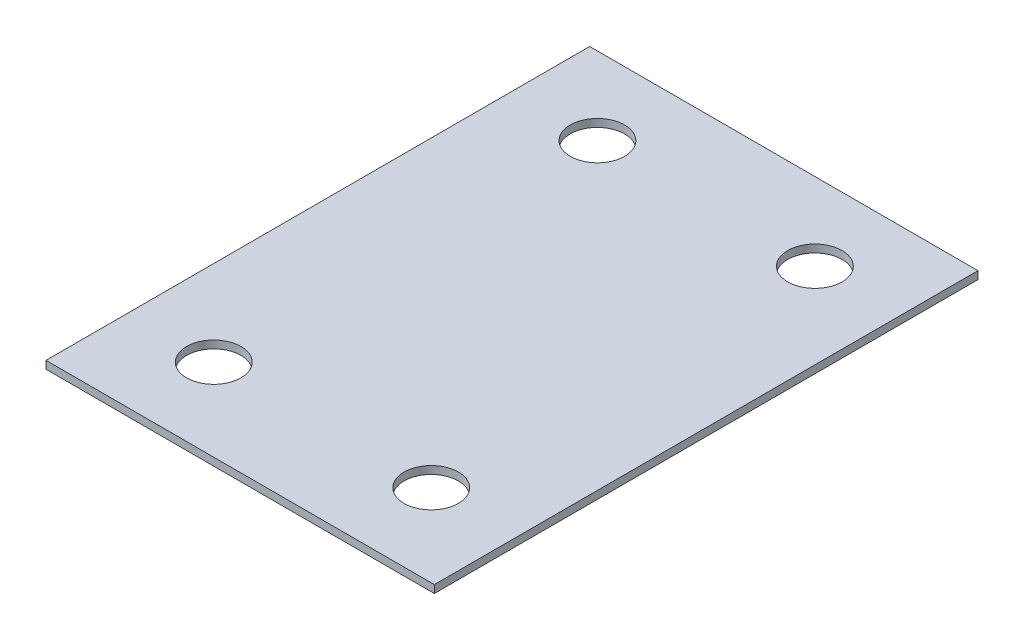
ISO-10303-21;
HEADER;
FILE_DESCRIPTION(('STEP AP214'),'2;1');
FILE_NAME('part.step','',(''),(''),'','','');
FILE_SCHEMA(('AUTOMOTIVE_DESIGN { 1 0 10303 214 1 1 1 1 }'));
ENDSEC;
DATA;
#1=APPLICATION_CONTEXT('core data for automotive mechanical design processes');
#2=APPLICATION_PROTOCOL_DEFINITION('international standard','automotive_design',2000,#1);
#3=PRODUCT_CONTEXT('',#1,'mechanical');
#4=PRODUCT('Part','Part','',(#3));
#5=PRODUCT_RELATED_PRODUCT_CATEGORY('part','',(#4));
#6=PRODUCT_DEFINITION_FORMATION('','',#4);
#7=PRODUCT_DEFINITION_CONTEXT('part definition',#1,'design');
#8=PRODUCT_DEFINITION('design','',#6,#7);
#9=PRODUCT_DEFINITION_SHAPE('','',#8);
#10=(LENGTH_UNIT() NAMED_UNIT(*) SI_UNIT(.MILLI.,.METRE.));
#11=(NAMED_UNIT(*) PLANE_ANGLE_UNIT() SI_UNIT($,.RADIAN.));
#12=(NAMED_UNIT(*) SI_UNIT($,.STERADIAN.) SOLID_ANGLE_UNIT());
#13=UNCERTAINTY_MEASURE_WITH_UNIT(LENGTH_MEASURE(1.E-05),#10,'distance_accuracy_value','');
#14=(GEOMETRIC_REPRESENTATION_CONTEXT(3) GLOBAL_UNCERTAINTY_ASSIGNED_CONTEXT((#13)) GLOBAL_UNIT_ASSIGNED_CONTEXT((#10,
#11,#12)) REPRESENTATION_CONTEXT('',''));
#15=CARTESIAN_POINT('',(0.,0.,0.));
#16=DIRECTION('',(0.,0.,1.));
#17=DIRECTION('',(1.,0.,0.));
#18=AXIS2_PLACEMENT_3D('',#15,#16,#17);
#19=CARTESIAN_POINT('',(0.,1.,0.));
#20=DIRECTION('',(0.,1.,0.));
#21=DIRECTION('',(0.,0.,1.));
#22=AXIS2_PLACEMENT_3D('',#19,#20,#21);
#23=PLANE('',#22);
#24=CARTESIAN_POINT('',(-14.,1.,24.4));
#25=DIRECTION('',(0.,1.,0.));
#26=DIRECTION('',(0.,0.,1.));
#27=AXIS2_PLACEMENT_3D('',#24,#25,#26);
#28=CIRCLE('',#27,3.5);
#29=CARTESIAN_POINT('',(-14.,1.,27.9));
#30=VERTEX_POINT('',#29);
#31=EDGE_CURVE('E92',#30,#30,#28,.F.);
#32=ORIENTED_EDGE('',*,*,#31,.T.);
#33=EDGE_LOOP('',(#32));
#34=FACE_BOUND('',#33,.T.);
#35=CARTESIAN_POINT('',(14.,1.,24.4));
#36=DIRECTION('',(0.,1.,0.));
#37=DIRECTION('',(0.,0.,1.));
#38=AXIS2_PLACEMENT_3D('',#35,#36,#37);
#39=CIRCLE('',#38,3.5);
#40=CARTESIAN_POINT('',(14.,1.,27.9));
#41=VERTEX_POINT('',#40);
#42=EDGE_CURVE('E95',#41,#41,#39,.F.);
#43=ORIENTED_EDGE('',*,*,#42,.T.);
#44=EDGE_LOOP('',(#43));
#45=FACE_BOUND('',#44,.T.);
#46=CARTESIAN_POINT('',(14.,1.,-25.));
#47=DIRECTION('',(0.,1.,0.));
#48=DIRECTION('',(0.,0.,1.));
#49=AXIS2_PLACEMENT_3D('',#46,#47,#48);
#50=CIRCLE('',#49,3.5);
#51=CARTESIAN_POINT('',(14.,1.,-21.5));
#52=VERTEX_POINT('',#51);
#53=EDGE_CURVE('E97',#52,#52,#50,.F.);
#54=ORIENTED_EDGE('',*,*,#53,.T.);
#55=EDGE_LOOP('',(#54));
#56=FACE_BOUND('',#55,.T.);
#57=CARTESIAN_POINT('',(-14.,1.,-25.));
#58=DIRECTION('',(0.,1.,0.));
#59=DIRECTION('',(0.,0.,1.));
#60=AXIS2_PLACEMENT_3D('',#57,#58,#59);
#61=CIRCLE('',#60,3.5);
#62=CARTESIAN_POINT('',(-14.,1.,-21.5));
#63=VERTEX_POINT('',#62);
#64=EDGE_CURVE('E20',#63,#63,#61,.F.);
#65=ORIENTED_EDGE('',*,*,#64,.T.);
#66=EDGE_LOOP('',(#65));
#67=FACE_BOUND('',#66,.T.);
#68=DIRECTION('',(-1.,0.,0.));
#69=VECTOR('',#68,1.);
#70=CARTESIAN_POINT('',(25.,1.,-35.));
#71=LINE('',#70,#69);
#72=CARTESIAN_POINT('',(-25.,1.,-35.));
#73=VERTEX_POINT('',#72);
#74=CARTESIAN_POINT('',(25.,1.,-35.));
#75=VERTEX_POINT('',#74);
#76=EDGE_CURVE('E71',#73,#75,#71,.F.);
#77=ORIENTED_EDGE('',*,*,#76,.F.);
#78=DIRECTION('',(0.,0.,1.));
#79=VECTOR('',#78,1.);
#80=CARTESIAN_POINT('',(-25.,1.,-35.));
#81=LINE('',#80,#79);
#82=CARTESIAN_POINT('',(-25.,1.,35.));
#83=VERTEX_POINT('',#82);
#84=EDGE_CURVE('E68',#83,#73,#81,.F.);
#85=ORIENTED_EDGE('',*,*,#84,.F.);
#86=DIRECTION('',(1.,0.,0.));
#87=VECTOR('',#86,1.);
#88=CARTESIAN_POINT('',(-25.,1.,35.));
#89=LINE('',#88,#87);
#90=CARTESIAN_POINT('',(25.,1.,35.));
#91=VERTEX_POINT('',#90);
#92=EDGE_CURVE('E59',#91,#83,#89,.F.);
#93=ORIENTED_EDGE('',*,*,#92,.F.);
#94=DIRECTION('',(0.,0.,-1.));
#95=VECTOR('',#94,1.);
#96=CARTESIAN_POINT('',(25.,1.,35.));
#97=LINE('',#96,#95);
#98=EDGE_CURVE('E54',#75,#91,#97,.F.);
#99=ORIENTED_EDGE('',*,*,#98,.F.);
#100=EDGE_LOOP('',(#77,#85,#93,#99));
#101=FACE_BOUND('',#100,.T.);
#102=ADVANCED_FACE('F17',(#34,#45,#56,#67,#101),#23,.T.);
#103=CARTESIAN_POINT('',(-25.,0.,-35.));
#104=DIRECTION('',(-1.,0.,0.));
#105=DIRECTION('',(0.,0.,1.));
#106=AXIS2_PLACEMENT_3D('',#103,#104,#105);
#107=PLANE('',#106);
#108=DIRECTION('',(0.,1.,0.));
#109=VECTOR('',#108,1.);
#110=CARTESIAN_POINT('',(-25.,0.,-35.));
#111=LINE('',#110,#109);
#112=CARTESIAN_POINT('',(-25.,0.,-35.));
#113=VERTEX_POINT('',#112);
#114=EDGE_CURVE('E105',#113,#73,#111,.T.);
#115=ORIENTED_EDGE('',*,*,#114,.F.);
#116=DIRECTION('',(0.,0.,1.));
#117=VECTOR('',#116,1.);
#118=CARTESIAN_POINT('',(-25.,0.,0.));
#119=LINE('',#118,#117);
#120=CARTESIAN_POINT('',(-25.,0.,35.));
#121=VERTEX_POINT('',#120);
#122=EDGE_CURVE('E78',#113,#121,#119,.T.);
#123=ORIENTED_EDGE('',*,*,#122,.T.);
#124=DIRECTION('',(0.,1.,0.));
#125=VECTOR('',#124,1.);
#126=CARTESIAN_POINT('',(-25.,0.,35.));
#127=LINE('',#126,#125);
#128=EDGE_CURVE('E64',#83,#121,#127,.F.);
#129=ORIENTED_EDGE('',*,*,#128,.F.);
#130=ORIENTED_EDGE('',*,*,#84,.T.);
#131=EDGE_LOOP('',(#115,#123,#129,#130));
#132=FACE_BOUND('',#131,.T.);
#133=ADVANCED_FACE('F77',(#132),#107,.T.);
#134=CARTESIAN_POINT('',(-25.,0.,35.));
#135=DIRECTION('',(0.,0.,1.));
#136=DIRECTION('',(1.,0.,0.));
#137=AXIS2_PLACEMENT_3D('',#134,#135,#136);
#138=PLANE('',#137);
#139=ORIENTED_EDGE('',*,*,#128,.T.);
#140=DIRECTION('',(1.,0.,0.));
#141=VECTOR('',#140,1.);
#142=CARTESIAN_POINT('',(0.,0.,35.));
#143=LINE('',#142,#141);
#144=CARTESIAN_POINT('',(25.,0.,35.));
#145=VERTEX_POINT('',#144);
#146=EDGE_CURVE('E116',#121,#145,#143,.T.);
#147=ORIENTED_EDGE('',*,*,#146,.T.);
#148=DIRECTION('',(0.,1.,0.));
#149=VECTOR('',#148,1.);
#150=CARTESIAN_POINT('',(25.,0.,35.));
#151=LINE('',#150,#149);
#152=EDGE_CURVE('E66',#91,#145,#151,.F.);
#153=ORIENTED_EDGE('',*,*,#152,.F.);
#154=ORIENTED_EDGE('',*,*,#92,.T.);
#155=EDGE_LOOP('',(#139,#147,#153,#154));
#156=FACE_BOUND('',#155,.T.);
#157=ADVANCED_FACE('F61',(#156),#138,.T.);
#158=CARTESIAN_POINT('',(25.,0.,35.));
#159=DIRECTION('',(1.,0.,0.));
#160=DIRECTION('',(0.,0.,-1.));
#161=AXIS2_PLACEMENT_3D('',#158,#159,#160);
#162=PLANE('',#161);
#163=ORIENTED_EDGE('',*,*,#152,.T.);
#164=DIRECTION('',(0.,0.,1.));
#165=VECTOR('',#164,1.);
#166=CARTESIAN_POINT('',(25.,0.,0.));
#167=LINE('',#166,#165);
#168=CARTESIAN_POINT('',(25.,0.,-35.));
#169=VERTEX_POINT('',#168);
#170=EDGE_CURVE('E113',#145,#169,#167,.F.);
#171=ORIENTED_EDGE('',*,*,#170,.T.);
#172=DIRECTION('',(0.,1.,0.));
#173=VECTOR('',#172,1.);
#174=CARTESIAN_POINT('',(25.,0.,-35.));
#175=LINE('',#174,#173);
#176=EDGE_CURVE('E35',#75,#169,#175,.F.);
#177=ORIENTED_EDGE('',*,*,#176,.F.);
#178=ORIENTED_EDGE('',*,*,#98,.T.);
#179=EDGE_LOOP('',(#163,#171,#177,#178));
#180=FACE_BOUND('',#179,.T.);
#181=ADVANCED_FACE('F112',(#180),#162,.T.);
#182=CARTESIAN_POINT('',(25.,0.,-35.));
#183=DIRECTION('',(0.,0.,-1.));
#184=DIRECTION('',(-1.,0.,0.));
#185=AXIS2_PLACEMENT_3D('',#182,#183,#184);
#186=PLANE('',#185);
#187=ORIENTED_EDGE('',*,*,#176,.T.);
#188=DIRECTION('',(1.,0.,0.));
#189=VECTOR('',#188,1.);
#190=CARTESIAN_POINT('',(0.,0.,-35.));
#191=LINE('',#190,#189);
#192=EDGE_CURVE('E91',#169,#113,#191,.F.);
#193=ORIENTED_EDGE('',*,*,#192,.T.);
#194=ORIENTED_EDGE('',*,*,#114,.T.);
#195=ORIENTED_EDGE('',*,*,#76,.T.);
#196=EDGE_LOOP('',(#187,#193,#194,#195));
#197=FACE_BOUND('',#196,.T.);
#198=ADVANCED_FACE('F119',(#197),#186,.T.);
#199=CARTESIAN_POINT('',(-14.,0.,-25.));
#200=DIRECTION('',(0.,1.,0.));
#201=DIRECTION('',(0.,0.,1.));
#202=AXIS2_PLACEMENT_3D('',#199,#200,#201);
#203=CYLINDRICAL_SURFACE('',#202,3.5);
#204=ORIENTED_EDGE('',*,*,#64,.F.);
#205=EDGE_LOOP('',(#204));
#206=FACE_BOUND('',#205,.T.);
#207=CARTESIAN_POINT('',(-14.,0.,-25.));
#208=DIRECTION('',(0.,1.,0.));
#209=DIRECTION('',(0.,0.,1.));
#210=AXIS2_PLACEMENT_3D('',#207,#208,#209);
#211=CIRCLE('',#210,3.5);
#212=CARTESIAN_POINT('',(-14.,0.,-21.5));
#213=VERTEX_POINT('',#212);
#214=EDGE_CURVE('E88',#213,#213,#211,.F.);
#215=ORIENTED_EDGE('',*,*,#214,.T.);
#216=EDGE_LOOP('',(#215));
#217=FACE_BOUND('',#216,.T.);
#218=ADVANCED_FACE('F121',(#206,#217),#203,.F.);
#219=CARTESIAN_POINT('',(14.,0.,-25.));
#220=DIRECTION('',(0.,1.,0.));
#221=DIRECTION('',(0.,0.,1.));
#222=AXIS2_PLACEMENT_3D('',#219,#220,#221);
#223=CYLINDRICAL_SURFACE('',#222,3.5);
#224=ORIENTED_EDGE('',*,*,#53,.F.);
#225=EDGE_LOOP('',(#224));
#226=FACE_BOUND('',#225,.T.);
#227=CARTESIAN_POINT('',(14.,0.,-25.));
#228=DIRECTION('',(0.,1.,0.));
#229=DIRECTION('',(0.,0.,1.));
#230=AXIS2_PLACEMENT_3D('',#227,#228,#229);
#231=CIRCLE('',#230,3.5);
#232=CARTESIAN_POINT('',(14.,0.,-21.5));
#233=VERTEX_POINT('',#232);
#234=EDGE_CURVE('E85',#233,#233,#231,.F.);
#235=ORIENTED_EDGE('',*,*,#234,.T.);
#236=EDGE_LOOP('',(#235));
#237=FACE_BOUND('',#236,.T.);
#238=ADVANCED_FACE('F128',(#226,#237),#223,.F.);
#239=CARTESIAN_POINT('',(14.,0.,24.4));
#240=DIRECTION('',(0.,1.,0.));
#241=DIRECTION('',(0.,0.,1.));
#242=AXIS2_PLACEMENT_3D('',#239,#240,#241);
#243=CYLINDRICAL_SURFACE('',#242,3.5);
#244=ORIENTED_EDGE('',*,*,#42,.F.);
#245=EDGE_LOOP('',(#244));
#246=FACE_BOUND('',#245,.T.);
#247=CARTESIAN_POINT('',(14.,0.,24.4));
#248=DIRECTION('',(0.,1.,0.));
#249=DIRECTION('',(0.,0.,1.));
#250=AXIS2_PLACEMENT_3D('',#247,#248,#249);
#251=CIRCLE('',#250,3.5);
#252=CARTESIAN_POINT('',(14.,0.,27.9));
#253=VERTEX_POINT('',#252);
#254=EDGE_CURVE('E26',#253,#253,#251,.F.);
#255=ORIENTED_EDGE('',*,*,#254,.T.);
#256=EDGE_LOOP('',(#255));
#257=FACE_BOUND('',#256,.T.);
#258=ADVANCED_FACE('F139',(#246,#257),#243,.F.);
#259=CARTESIAN_POINT('',(-14.,0.,24.4));
#260=DIRECTION('',(0.,1.,0.));
#261=DIRECTION('',(0.,0.,1.));
#262=AXIS2_PLACEMENT_3D('',#259,#260,#261);
#263=CYLINDRICAL_SURFACE('',#262,3.5);
#264=ORIENTED_EDGE('',*,*,#31,.F.);
#265=EDGE_LOOP('',(#264));
#266=FACE_BOUND('',#265,.T.);
#267=CARTESIAN_POINT('',(-14.,0.,24.4));
#268=DIRECTION('',(0.,1.,0.));
#269=DIRECTION('',(0.,0.,1.));
#270=AXIS2_PLACEMENT_3D('',#267,#268,#269);
#271=CIRCLE('',#270,3.5);
#272=CARTESIAN_POINT('',(-14.,0.,27.9));
#273=VERTEX_POINT('',#272);
#274=EDGE_CURVE('E11',#273,#273,#271,.F.);
#275=ORIENTED_EDGE('',*,*,#274,.T.);
#276=EDGE_LOOP('',(#275));
#277=FACE_BOUND('',#276,.T.);
#278=ADVANCED_FACE('F133',(#266,#277),#263,.F.);
#279=CARTESIAN_POINT('',(0.,0.,0.));
#280=DIRECTION('',(0.,1.,0.));
#281=DIRECTION('',(0.,0.,1.));
#282=AXIS2_PLACEMENT_3D('',#279,#280,#281);
#283=PLANE('',#282);
#284=ORIENTED_EDGE('',*,*,#274,.F.);
#285=EDGE_LOOP('',(#284));
#286=FACE_BOUND('',#285,.T.);
#287=ORIENTED_EDGE('',*,*,#254,.F.);
#288=EDGE_LOOP('',(#287));
#289=FACE_BOUND('',#288,.T.);
#290=ORIENTED_EDGE('',*,*,#234,.F.);
#291=EDGE_LOOP('',(#290));
#292=FACE_BOUND('',#291,.T.);
#293=ORIENTED_EDGE('',*,*,#214,.F.);
#294=EDGE_LOOP('',(#293));
#295=FACE_BOUND('',#294,.T.);
#296=ORIENTED_EDGE('',*,*,#170,.F.);
#297=ORIENTED_EDGE('',*,*,#146,.F.);
#298=ORIENTED_EDGE('',*,*,#122,.F.);
#299=ORIENTED_EDGE('',*,*,#192,.F.);
#300=EDGE_LOOP('',(#296,#297,#298,#299));
#301=FACE_BOUND('',#300,.T.);
#302=ADVANCED_FACE('F115',(#286,#289,#292,#295,#301),#283,.F.);
#303=CLOSED_SHELL('',(#102,#133,#157,#181,#198,#218,#238,#258,#278,#302));
#304=MANIFOLD_SOLID_BREP('B1',#303);
#305=ADVANCED_BREP_SHAPE_REPRESENTATION('',(#18,#304),#14);
#306=SHAPE_DEFINITION_REPRESENTATION(#9,#305);
ENDSEC;
END-ISO-10303-21;
